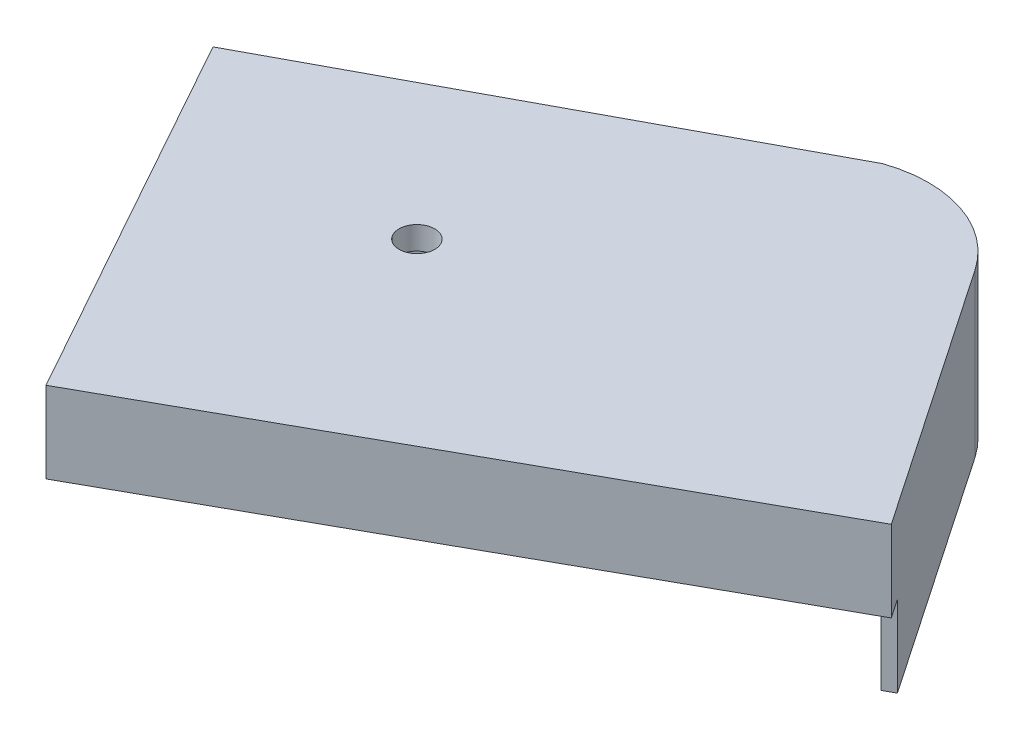
ISO-10303-21;
HEADER;
FILE_DESCRIPTION(('STEP AP214'),'2;1');
FILE_NAME('part.step','',(''),(''),'','','');
FILE_SCHEMA(('AUTOMOTIVE_DESIGN { 1 0 10303 214 1 1 1 1 }'));
ENDSEC;
DATA;
#1=APPLICATION_CONTEXT('core data for automotive mechanical design processes');
#2=APPLICATION_PROTOCOL_DEFINITION('international standard','automotive_design',2000,#1);
#3=PRODUCT_CONTEXT('',#1,'mechanical');
#4=PRODUCT('Part','Part','',(#3));
#5=PRODUCT_RELATED_PRODUCT_CATEGORY('part','',(#4));
#6=PRODUCT_DEFINITION_FORMATION('','',#4);
#7=PRODUCT_DEFINITION_CONTEXT('part definition',#1,'design');
#8=PRODUCT_DEFINITION('design','',#6,#7);
#9=PRODUCT_DEFINITION_SHAPE('','',#8);
#10=(LENGTH_UNIT() NAMED_UNIT(*) SI_UNIT(.MILLI.,.METRE.));
#11=(NAMED_UNIT(*) PLANE_ANGLE_UNIT() SI_UNIT($,.RADIAN.));
#12=(NAMED_UNIT(*) SI_UNIT($,.STERADIAN.) SOLID_ANGLE_UNIT());
#13=UNCERTAINTY_MEASURE_WITH_UNIT(LENGTH_MEASURE(1.E-05),#10,'distance_accuracy_value','');
#14=(GEOMETRIC_REPRESENTATION_CONTEXT(3) GLOBAL_UNCERTAINTY_ASSIGNED_CONTEXT((#13)) GLOBAL_UNIT_ASSIGNED_CONTEXT((#10,
#11,#12)) REPRESENTATION_CONTEXT('',''));
#15=CARTESIAN_POINT('',(0.,0.,0.));
#16=DIRECTION('',(0.,0.,1.));
#17=DIRECTION('',(1.,0.,0.));
#18=AXIS2_PLACEMENT_3D('',#15,#16,#17);
#19=CARTESIAN_POINT('',(33.7235314747771,0.,-41.3466522137133));
#20=DIRECTION('',(0.,1.,0.));
#21=DIRECTION('',(0.,0.,1.));
#22=AXIS2_PLACEMENT_3D('',#19,#20,#21);
#23=PLANE('',#22);
#24=DIRECTION('',(-0.881351269139072,0.,0.472461575566677));
#25=VECTOR('',#24,1.);
#26=CARTESIAN_POINT('',(26.0520217882454,0.,-63.8121594780564));
#27=LINE('',#26,#25);
#28=CARTESIAN_POINT('',(26.0520217882454,0.,-63.8121594780564));
#29=VERTEX_POINT('',#28);
#30=CARTESIAN_POINT('',(-65.4054363652947,0.,-14.7850163972348));
#31=VERTEX_POINT('',#30);
#32=EDGE_CURVE('E236',#29,#31,#27,.T.);
#33=ORIENTED_EDGE('',*,*,#32,.T.);
#34=DIRECTION('',(-0.486303730556802,0.,-0.873789838374502));
#35=VECTOR('',#34,1.);
#36=CARTESIAN_POINT('',(-22.9517138957504,0.,61.4957706174684));
#37=LINE('',#36,#35);
#38=CARTESIAN_POINT('',(-66.6883155522428,0.,-17.0900918613566));
#39=VERTEX_POINT('',#38);
#40=EDGE_CURVE('E277',#31,#39,#37,.T.);
#41=ORIENTED_EDGE('',*,*,#40,.T.);
#42=DIRECTION('',(-0.881351269139072,0.,0.472461575566677));
#43=VECTOR('',#42,1.);
#44=CARTESIAN_POINT('',(24.9906878047222,0.,-66.2359975735314));
#45=LINE('',#44,#43);
#46=CARTESIAN_POINT('',(24.9906878047222,0.,-66.2359975735316));
#47=VERTEX_POINT('',#46);
#48=EDGE_CURVE('E126',#47,#39,#45,.T.);
#49=ORIENTED_EDGE('',*,*,#48,.F.);
#50=CARTESIAN_POINT('',(33.7235314747771,0.,-41.3466522137133));
#51=DIRECTION('',(0.,1.,0.));
#52=DIRECTION('',(0.,0.,1.));
#53=AXIS2_PLACEMENT_3D('',#50,#51,#52);
#54=CIRCLE('',#53,26.3769230769233);
#55=CARTESIAN_POINT('',(55.5294197087094,0.,-56.187316260015));
#56=VERTEX_POINT('',#55);
#57=EDGE_CURVE('E108',#56,#47,#54,.T.);
#58=ORIENTED_EDGE('',*,*,#57,.F.);
#59=DIRECTION('',(-0.562638181982848,0.,-0.826703257629384));
#60=VECTOR('',#59,1.);
#61=CARTESIAN_POINT('',(94.9288709079823,0.,1.70362626446839));
#62=LINE('',#61,#60);
#63=CARTESIAN_POINT('',(92.0591266966087,0.,-2.51298569696083));
#64=VERTEX_POINT('',#63);
#65=EDGE_CURVE('E75',#64,#56,#62,.T.);
#66=ORIENTED_EDGE('',*,*,#65,.F.);
#67=DIRECTION('',(0.873789838374501,0.,-0.486303730556803));
#68=VECTOR('',#67,1.);
#69=CARTESIAN_POINT('',(-27.3905662746929,0.,63.966193568697));
#70=LINE('',#69,#68);
#71=CARTESIAN_POINT('',(89.7450305573049,0.,-1.22508609457588));
#72=VERTEX_POINT('',#71);
#73=EDGE_CURVE('E267',#72,#64,#70,.T.);
#74=ORIENTED_EDGE('',*,*,#73,.F.);
#75=DIRECTION('',(-0.562638181982847,0.,-0.826703257629385));
#76=VECTOR('',#75,1.);
#77=CARTESIAN_POINT('',(91.1247152743114,0.,0.802131194572775));
#78=LINE('',#77,#76);
#79=CARTESIAN_POINT('',(53.3488308853161,0.,-54.7032498553848));
#80=VERTEX_POINT('',#79);
#81=EDGE_CURVE('E137',#72,#80,#78,.T.);
#82=ORIENTED_EDGE('',*,*,#81,.T.);
#83=CARTESIAN_POINT('',(33.7235314747771,0.,-41.3466522137133));
#84=DIRECTION('',(0.,1.,0.));
#85=DIRECTION('',(0.,0.,1.));
#86=AXIS2_PLACEMENT_3D('',#83,#84,#85);
#87=CIRCLE('',#86,23.7392307692311);
#88=EDGE_CURVE('E230',#80,#29,#87,.T.);
#89=ORIENTED_EDGE('',*,*,#88,.T.);
#90=EDGE_LOOP('',(#33,#41,#49,#58,#66,#74,#82,#89));
#91=FACE_BOUND('',#90,.T.);
#92=ADVANCED_FACE('F34',(#91),#23,.F.);
#93=CARTESIAN_POINT('',(94.9288709079823,35.814,1.70362626446839));
#94=DIRECTION('',(0.486303730556803,0.,0.873789838374501));
#95=DIRECTION('',(0.873789838374501,0.,-0.486303730556802));
#96=AXIS2_PLACEMENT_3D('',#93,#94,#95);
#97=PLANE('',#96);
#98=DIRECTION('',(-0.873789838374501,0.,0.486303730556803));
#99=VECTOR('',#98,1.);
#100=CARTESIAN_POINT('',(-24.9201433234643,17.907,68.4050459476394));
#101=LINE('',#100,#99);
#102=CARTESIAN_POINT('',(94.9288709079823,17.907,1.70362626446838));
#103=VERTEX_POINT('',#102);
#104=CARTESIAN_POINT('',(-24.9201433234643,17.907,68.4050459476394));
#105=VERTEX_POINT('',#104);
#106=EDGE_CURVE('E265',#103,#105,#101,.T.);
#107=ORIENTED_EDGE('',*,*,#106,.F.);
#108=DIRECTION('',(0.,-1.,0.));
#109=VECTOR('',#108,1.);
#110=CARTESIAN_POINT('',(94.9288709079823,35.814,1.70362626446839));
#111=LINE('',#110,#109);
#112=CARTESIAN_POINT('',(94.9288709079823,35.814,1.70362626446839));
#113=VERTEX_POINT('',#112);
#114=EDGE_CURVE('E58',#113,#103,#111,.T.);
#115=ORIENTED_EDGE('',*,*,#114,.F.);
#116=DIRECTION('',(-0.873789838374501,0.,0.486303730556802));
#117=VECTOR('',#116,1.);
#118=CARTESIAN_POINT('',(94.9288709079823,35.814,1.70362626446839));
#119=LINE('',#118,#117);
#120=CARTESIAN_POINT('',(-24.9201433234643,35.814,68.4050459476394));
#121=VERTEX_POINT('',#120);
#122=EDGE_CURVE('E121',#113,#121,#119,.T.);
#123=ORIENTED_EDGE('',*,*,#122,.T.);
#124=DIRECTION('',(0.,-1.,0.));
#125=VECTOR('',#124,1.);
#126=CARTESIAN_POINT('',(-24.9201433234643,35.814,68.4050459476394));
#127=LINE('',#126,#125);
#128=EDGE_CURVE('E84',#121,#105,#127,.T.);
#129=ORIENTED_EDGE('',*,*,#128,.T.);
#130=EDGE_LOOP('',(#107,#115,#123,#129));
#131=FACE_BOUND('',#130,.T.);
#132=ADVANCED_FACE('F36',(#131),#97,.T.);
#133=CARTESIAN_POINT('',(94.9288709079823,35.814,1.70362626446839));
#134=DIRECTION('',(-0.826703257629384,0.,0.562638181982848));
#135=DIRECTION('',(0.562638181982848,0.,0.826703257629384));
#136=AXIS2_PLACEMENT_3D('',#133,#134,#135);
#137=PLANE('',#136);
#138=ORIENTED_EDGE('',*,*,#114,.T.);
#139=DIRECTION('',(-0.562638181982848,0.,-0.826703257629384));
#140=VECTOR('',#139,1.);
#141=CARTESIAN_POINT('',(94.9288709079823,17.907,1.70362626446839));
#142=LINE('',#141,#140);
#143=CARTESIAN_POINT('',(92.0591266966087,17.907,-2.51298569696083));
#144=VERTEX_POINT('',#143);
#145=EDGE_CURVE('E257',#103,#144,#142,.T.);
#146=ORIENTED_EDGE('',*,*,#145,.T.);
#147=DIRECTION('',(0.,-1.,0.));
#148=VECTOR('',#147,1.);
#149=CARTESIAN_POINT('',(92.0591266966086,35.814,-2.51298569696083));
#150=LINE('',#149,#148);
#151=EDGE_CURVE('E253',#144,#64,#150,.T.);
#152=ORIENTED_EDGE('',*,*,#151,.T.);
#153=ORIENTED_EDGE('',*,*,#65,.T.);
#154=DIRECTION('',(0.,-1.,0.));
#155=VECTOR('',#154,1.);
#156=CARTESIAN_POINT('',(55.5294197087094,35.814,-56.187316260015));
#157=LINE('',#156,#155);
#158=CARTESIAN_POINT('',(55.5294197087094,35.814,-56.187316260015));
#159=VERTEX_POINT('',#158);
#160=EDGE_CURVE('E112',#159,#56,#157,.T.);
#161=ORIENTED_EDGE('',*,*,#160,.F.);
#162=DIRECTION('',(-0.562638181982848,0.,-0.826703257629384));
#163=VECTOR('',#162,1.);
#164=CARTESIAN_POINT('',(94.9288709079823,35.814,1.70362626446839));
#165=LINE('',#164,#163);
#166=EDGE_CURVE('E101',#113,#159,#165,.T.);
#167=ORIENTED_EDGE('',*,*,#166,.F.);
#168=EDGE_LOOP('',(#138,#146,#152,#153,#161,#167));
#169=FACE_BOUND('',#168,.T.);
#170=ADVANCED_FACE('F308',(#169),#137,.F.);
#171=CARTESIAN_POINT('',(33.7235314747771,35.814,-41.3466522137133));
#172=DIRECTION('',(0.,-1.,0.));
#173=DIRECTION('',(0.,0.,-1.));
#174=AXIS2_PLACEMENT_3D('',#171,#172,#173);
#175=CYLINDRICAL_SURFACE('',#174,26.3769230769233);
#176=ORIENTED_EDGE('',*,*,#57,.T.);
#177=DIRECTION('',(0.,-1.,0.));
#178=VECTOR('',#177,1.);
#179=CARTESIAN_POINT('',(24.9906878047222,35.814,-66.2359975735316));
#180=LINE('',#179,#178);
#181=CARTESIAN_POINT('',(24.9906878047222,35.814,-66.2359975735316));
#182=VERTEX_POINT('',#181);
#183=EDGE_CURVE('E105',#182,#47,#180,.T.);
#184=ORIENTED_EDGE('',*,*,#183,.F.);
#185=CARTESIAN_POINT('',(33.7235314747771,35.814,-41.3466522137133));
#186=DIRECTION('',(0.,1.,0.));
#187=DIRECTION('',(0.,0.,1.));
#188=AXIS2_PLACEMENT_3D('',#185,#186,#187);
#189=CIRCLE('',#188,26.3769230769233);
#190=EDGE_CURVE('E94',#159,#182,#189,.T.);
#191=ORIENTED_EDGE('',*,*,#190,.F.);
#192=ORIENTED_EDGE('',*,*,#160,.T.);
#193=EDGE_LOOP('',(#176,#184,#191,#192));
#194=FACE_BOUND('',#193,.T.);
#195=ADVANCED_FACE('F106',(#194),#175,.T.);
#196=CARTESIAN_POINT('',(24.9906878047222,35.814,-66.2359975735314));
#197=DIRECTION('',(0.472461575566677,0.,0.881351269139072));
#198=DIRECTION('',(0.881351269139072,0.,-0.472461575566677));
#199=AXIS2_PLACEMENT_3D('',#196,#197,#198);
#200=PLANE('',#199);
#201=DIRECTION('',(0.,1.,0.));
#202=VECTOR('',#201,1.);
#203=CARTESIAN_POINT('',(-66.6883155522428,35.814,-17.0900918613566));
#204=LINE('',#203,#202);
#205=CARTESIAN_POINT('',(-66.6883155522428,17.907,-17.0900918613566));
#206=VERTEX_POINT('',#205);
#207=EDGE_CURVE('E268',#39,#206,#204,.T.);
#208=ORIENTED_EDGE('',*,*,#207,.T.);
#209=DIRECTION('',(-0.881351269139072,0.,0.472461575566677));
#210=VECTOR('',#209,1.);
#211=CARTESIAN_POINT('',(24.9906878047222,17.907,-66.2359975735314));
#212=LINE('',#211,#210);
#213=CARTESIAN_POINT('',(-71.1661369967758,17.907,-14.689688470712));
#214=VERTEX_POINT('',#213);
#215=EDGE_CURVE('E273',#206,#214,#212,.T.);
#216=ORIENTED_EDGE('',*,*,#215,.T.);
#217=DIRECTION('',(0.,-1.,0.));
#218=VECTOR('',#217,1.);
#219=CARTESIAN_POINT('',(-71.1661369967757,35.814,-14.6896884707121));
#220=LINE('',#219,#218);
#221=CARTESIAN_POINT('',(-71.1661369967757,35.814,-14.6896884707121));
#222=VERTEX_POINT('',#221);
#223=EDGE_CURVE('E113',#222,#214,#220,.T.);
#224=ORIENTED_EDGE('',*,*,#223,.F.);
#225=DIRECTION('',(-0.881351269139072,0.,0.472461575566677));
#226=VECTOR('',#225,1.);
#227=CARTESIAN_POINT('',(24.9906878047222,35.814,-66.2359975735314));
#228=LINE('',#227,#226);
#229=EDGE_CURVE('E99',#182,#222,#228,.T.);
#230=ORIENTED_EDGE('',*,*,#229,.F.);
#231=ORIENTED_EDGE('',*,*,#183,.T.);
#232=ORIENTED_EDGE('',*,*,#48,.T.);
#233=EDGE_LOOP('',(#208,#216,#224,#230,#231,#232));
#234=FACE_BOUND('',#233,.T.);
#235=ADVANCED_FACE('F116',(#234),#200,.F.);
#236=CARTESIAN_POINT('',(-24.9201433234643,35.814,68.4050459476394));
#237=DIRECTION('',(-0.873789838374501,0.,0.486303730556802));
#238=DIRECTION('',(0.486303730556802,0.,0.873789838374502));
#239=AXIS2_PLACEMENT_3D('',#236,#237,#238);
#240=PLANE('',#239);
#241=ORIENTED_EDGE('',*,*,#223,.T.);
#242=DIRECTION('',(0.486303730556803,0.,0.873789838374501));
#243=VECTOR('',#242,1.);
#244=CARTESIAN_POINT('',(-27.3905662746929,17.907,63.966193568697));
#245=LINE('',#244,#243);
#246=EDGE_CURVE('E176',#214,#105,#245,.T.);
#247=ORIENTED_EDGE('',*,*,#246,.T.);
#248=ORIENTED_EDGE('',*,*,#128,.F.);
#249=DIRECTION('',(-0.486303730556802,0.,-0.873789838374501));
#250=VECTOR('',#249,1.);
#251=CARTESIAN_POINT('',(-24.9201433234643,35.814,68.4050459476394));
#252=LINE('',#251,#250);
#253=EDGE_CURVE('E119',#121,#222,#252,.T.);
#254=ORIENTED_EDGE('',*,*,#253,.T.);
#255=EDGE_LOOP('',(#241,#247,#248,#254));
#256=FACE_BOUND('',#255,.T.);
#257=ADVANCED_FACE('F173',(#256),#240,.T.);
#258=CARTESIAN_POINT('',(33.7235314747771,35.814,-41.3466522137133));
#259=DIRECTION('',(0.,1.,0.));
#260=DIRECTION('',(0.,0.,1.));
#261=AXIS2_PLACEMENT_3D('',#258,#259,#260);
#262=PLANE('',#261);
#263=CARTESIAN_POINT('',(-11.9241561411378,35.814,-0.453613659759336));
#264=DIRECTION('',(0.,1.,0.));
#265=DIRECTION('',(0.,0.,1.));
#266=AXIS2_PLACEMENT_3D('',#263,#264,#265);
#267=CIRCLE('',#266,3.937);
#268=CARTESIAN_POINT('',(-11.9241561411378,35.814,3.48338634024066));
#269=VERTEX_POINT('',#268);
#270=EDGE_CURVE('E138',#269,#269,#267,.T.);
#271=ORIENTED_EDGE('',*,*,#270,.F.);
#272=EDGE_LOOP('',(#271));
#273=FACE_BOUND('',#272,.T.);
#274=ORIENTED_EDGE('',*,*,#122,.F.);
#275=ORIENTED_EDGE('',*,*,#166,.T.);
#276=ORIENTED_EDGE('',*,*,#190,.T.);
#277=ORIENTED_EDGE('',*,*,#229,.T.);
#278=ORIENTED_EDGE('',*,*,#253,.F.);
#279=EDGE_LOOP('',(#274,#275,#276,#277,#278));
#280=FACE_BOUND('',#279,.T.);
#281=ADVANCED_FACE('F97',(#273,#280),#262,.T.);
#282=CARTESIAN_POINT('',(91.1247152743114,30.734,0.802131194572775));
#283=DIRECTION('',(-0.826703257629384,0.,0.562638181982847));
#284=DIRECTION('',(0.562638181982847,0.,0.826703257629385));
#285=AXIS2_PLACEMENT_3D('',#282,#283,#284);
#286=PLANE('',#285);
#287=DIRECTION('',(-0.562638181982847,0.,-0.826703257629385));
#288=VECTOR('',#287,1.);
#289=CARTESIAN_POINT('',(91.1247152743114,17.907,0.802131194572775));
#290=LINE('',#289,#288);
#291=CARTESIAN_POINT('',(91.1247152743114,17.907,0.802131194572775));
#292=VERTEX_POINT('',#291);
#293=CARTESIAN_POINT('',(89.7450305573049,17.907,-1.22508609457588));
#294=VERTEX_POINT('',#293);
#295=EDGE_CURVE('E260',#292,#294,#290,.T.);
#296=ORIENTED_EDGE('',*,*,#295,.F.);
#297=DIRECTION('',(0.,-1.,0.));
#298=VECTOR('',#297,1.);
#299=CARTESIAN_POINT('',(91.1247152743114,30.734,0.802131194572775));
#300=LINE('',#299,#298);
#301=CARTESIAN_POINT('',(91.1247152743114,30.734,0.802131194572775));
#302=VERTEX_POINT('',#301);
#303=EDGE_CURVE('E150',#302,#292,#300,.T.);
#304=ORIENTED_EDGE('',*,*,#303,.F.);
#305=DIRECTION('',(-0.562638181982847,0.,-0.826703257629385));
#306=VECTOR('',#305,1.);
#307=CARTESIAN_POINT('',(91.1247152743114,30.734,0.802131194572775));
#308=LINE('',#307,#306);
#309=CARTESIAN_POINT('',(53.3488308853161,30.734,-54.7032498553848));
#310=VERTEX_POINT('',#309);
#311=EDGE_CURVE('E240',#302,#310,#308,.T.);
#312=ORIENTED_EDGE('',*,*,#311,.T.);
#313=DIRECTION('',(0.,-1.,0.));
#314=VECTOR('',#313,1.);
#315=CARTESIAN_POINT('',(53.3488308853161,30.734,-54.7032498553848));
#316=LINE('',#315,#314);
#317=EDGE_CURVE('E128',#310,#80,#316,.T.);
#318=ORIENTED_EDGE('',*,*,#317,.T.);
#319=ORIENTED_EDGE('',*,*,#81,.F.);
#320=DIRECTION('',(0.,-1.,0.));
#321=VECTOR('',#320,1.);
#322=CARTESIAN_POINT('',(89.7450305573048,30.734,-1.22508609457587));
#323=LINE('',#322,#321);
#324=EDGE_CURVE('E255',#294,#72,#323,.T.);
#325=ORIENTED_EDGE('',*,*,#324,.F.);
#326=EDGE_LOOP('',(#296,#304,#312,#318,#319,#325));
#327=FACE_BOUND('',#326,.T.);
#328=ADVANCED_FACE('F287',(#327),#286,.T.);
#329=CARTESIAN_POINT('',(33.7235314747771,30.734,-41.3466522137133));
#330=DIRECTION('',(0.,-1.,0.));
#331=DIRECTION('',(0.,0.,-1.));
#332=AXIS2_PLACEMENT_3D('',#329,#330,#331);
#333=CYLINDRICAL_SURFACE('',#332,23.7392307692311);
#334=ORIENTED_EDGE('',*,*,#88,.F.);
#335=ORIENTED_EDGE('',*,*,#317,.F.);
#336=CARTESIAN_POINT('',(33.7235314747771,30.734,-41.3466522137133));
#337=DIRECTION('',(0.,1.,0.));
#338=DIRECTION('',(0.,0.,1.));
#339=AXIS2_PLACEMENT_3D('',#336,#337,#338);
#340=CIRCLE('',#339,23.7392307692311);
#341=CARTESIAN_POINT('',(26.0520217882454,30.734,-63.8121594780564));
#342=VERTEX_POINT('',#341);
#343=EDGE_CURVE('E231',#310,#342,#340,.T.);
#344=ORIENTED_EDGE('',*,*,#343,.T.);
#345=DIRECTION('',(0.,-1.,0.));
#346=VECTOR('',#345,1.);
#347=CARTESIAN_POINT('',(26.0520217882454,30.734,-63.8121594780564));
#348=LINE('',#347,#346);
#349=EDGE_CURVE('E163',#342,#29,#348,.T.);
#350=ORIENTED_EDGE('',*,*,#349,.T.);
#351=EDGE_LOOP('',(#334,#335,#344,#350));
#352=FACE_BOUND('',#351,.T.);
#353=ADVANCED_FACE('F228',(#352),#333,.F.);
#354=CARTESIAN_POINT('',(26.0520217882454,30.734,-63.8121594780564));
#355=DIRECTION('',(0.472461575566677,0.,0.881351269139072));
#356=DIRECTION('',(0.881351269139072,0.,-0.472461575566677));
#357=AXIS2_PLACEMENT_3D('',#354,#355,#356);
#358=PLANE('',#357);
#359=DIRECTION('',(-0.881351269139072,0.,0.472461575566677));
#360=VECTOR('',#359,1.);
#361=CARTESIAN_POINT('',(26.0520217882454,17.907,-63.8121594780564));
#362=LINE('',#361,#360);
#363=CARTESIAN_POINT('',(-65.4054363652947,17.907,-14.7850163972348));
#364=VERTEX_POINT('',#363);
#365=CARTESIAN_POINT('',(-67.5582351367047,17.907,-13.6309763055788));
#366=VERTEX_POINT('',#365);
#367=EDGE_CURVE('E275',#364,#366,#362,.T.);
#368=ORIENTED_EDGE('',*,*,#367,.F.);
#369=DIRECTION('',(0.,1.,0.));
#370=VECTOR('',#369,1.);
#371=CARTESIAN_POINT('',(-65.4054363652947,30.734,-14.7850163972348));
#372=LINE('',#371,#370);
#373=EDGE_CURVE('E11',#31,#364,#372,.T.);
#374=ORIENTED_EDGE('',*,*,#373,.F.);
#375=ORIENTED_EDGE('',*,*,#32,.F.);
#376=ORIENTED_EDGE('',*,*,#349,.F.);
#377=DIRECTION('',(-0.881351269139072,0.,0.472461575566677));
#378=VECTOR('',#377,1.);
#379=CARTESIAN_POINT('',(26.0520217882454,30.734,-63.8121594780564));
#380=LINE('',#379,#378);
#381=CARTESIAN_POINT('',(-67.5582351367047,30.734,-13.6309763055788));
#382=VERTEX_POINT('',#381);
#383=EDGE_CURVE('E246',#342,#382,#380,.T.);
#384=ORIENTED_EDGE('',*,*,#383,.T.);
#385=DIRECTION('',(0.,-1.,0.));
#386=VECTOR('',#385,1.);
#387=CARTESIAN_POINT('',(-67.5582351367047,30.734,-13.6309763055788));
#388=LINE('',#387,#386);
#389=EDGE_CURVE('E160',#382,#366,#388,.T.);
#390=ORIENTED_EDGE('',*,*,#389,.T.);
#391=EDGE_LOOP('',(#368,#374,#375,#376,#384,#390));
#392=FACE_BOUND('',#391,.T.);
#393=ADVANCED_FACE('F238',(#392),#358,.T.);
#394=CARTESIAN_POINT('',(-23.8980741975359,30.734,64.8175376031275));
#395=DIRECTION('',(-0.873789838374502,0.,0.486303730556802));
#396=DIRECTION('',(0.486303730556802,0.,0.873789838374502));
#397=AXIS2_PLACEMENT_3D('',#394,#395,#396);
#398=PLANE('',#397);
#399=DIRECTION('',(-0.486303730556802,0.,-0.873789838374502));
#400=VECTOR('',#399,1.);
#401=CARTESIAN_POINT('',(-23.8980741975359,17.907,64.8175376031275));
#402=LINE('',#401,#400);
#403=CARTESIAN_POINT('',(-23.8980741975359,17.907,64.8175376031275));
#404=VERTEX_POINT('',#403);
#405=EDGE_CURVE('E49',#404,#366,#402,.T.);
#406=ORIENTED_EDGE('',*,*,#405,.T.);
#407=ORIENTED_EDGE('',*,*,#389,.F.);
#408=DIRECTION('',(-0.486303730556802,0.,-0.873789838374502));
#409=VECTOR('',#408,1.);
#410=CARTESIAN_POINT('',(-23.8980741975359,30.734,64.8175376031275));
#411=LINE('',#410,#409);
#412=CARTESIAN_POINT('',(-23.8980741975359,30.734,64.8175376031275));
#413=VERTEX_POINT('',#412);
#414=EDGE_CURVE('E158',#413,#382,#411,.T.);
#415=ORIENTED_EDGE('',*,*,#414,.F.);
#416=DIRECTION('',(0.,-1.,0.));
#417=VECTOR('',#416,1.);
#418=CARTESIAN_POINT('',(-23.8980741975359,30.734,64.8175376031275));
#419=LINE('',#418,#417);
#420=EDGE_CURVE('E146',#413,#404,#419,.T.);
#421=ORIENTED_EDGE('',*,*,#420,.T.);
#422=EDGE_LOOP('',(#406,#407,#415,#421));
#423=FACE_BOUND('',#422,.T.);
#424=ADVANCED_FACE('F154',(#423),#398,.F.);
#425=CARTESIAN_POINT('',(91.1247152743114,30.734,0.802131194572775));
#426=DIRECTION('',(0.486303730556803,0.,0.873789838374501));
#427=DIRECTION('',(0.873789838374501,0.,-0.486303730556803));
#428=AXIS2_PLACEMENT_3D('',#425,#426,#427);
#429=PLANE('',#428);
#430=ORIENTED_EDGE('',*,*,#303,.T.);
#431=DIRECTION('',(-0.873789838374501,0.,0.486303730556803));
#432=VECTOR('',#431,1.);
#433=CARTESIAN_POINT('',(91.1247152743114,17.907,0.802131194572775));
#434=LINE('',#433,#432);
#435=EDGE_CURVE('E42',#292,#404,#434,.T.);
#436=ORIENTED_EDGE('',*,*,#435,.T.);
#437=ORIENTED_EDGE('',*,*,#420,.F.);
#438=DIRECTION('',(-0.873789838374501,0.,0.486303730556803));
#439=VECTOR('',#438,1.);
#440=CARTESIAN_POINT('',(91.1247152743114,30.734,0.802131194572775));
#441=LINE('',#440,#439);
#442=EDGE_CURVE('E165',#302,#413,#441,.T.);
#443=ORIENTED_EDGE('',*,*,#442,.F.);
#444=EDGE_LOOP('',(#430,#436,#437,#443));
#445=FACE_BOUND('',#444,.T.);
#446=ADVANCED_FACE('F143',(#445),#429,.F.);
#447=CARTESIAN_POINT('',(33.7235314747771,30.734,-41.3466522137133));
#448=DIRECTION('',(0.,1.,0.));
#449=DIRECTION('',(0.,0.,1.));
#450=AXIS2_PLACEMENT_3D('',#447,#448,#449);
#451=PLANE('',#450);
#452=CARTESIAN_POINT('',(-11.9241561411378,30.734,-0.453613659759336));
#453=DIRECTION('',(0.,1.,0.));
#454=DIRECTION('',(0.,0.,1.));
#455=AXIS2_PLACEMENT_3D('',#452,#453,#454);
#456=CIRCLE('',#455,3.937);
#457=CARTESIAN_POINT('',(-11.9241561411378,30.734,3.48338634024066));
#458=VERTEX_POINT('',#457);
#459=EDGE_CURVE('E135',#458,#458,#456,.T.);
#460=ORIENTED_EDGE('',*,*,#459,.T.);
#461=EDGE_LOOP('',(#460));
#462=FACE_BOUND('',#461,.T.);
#463=ORIENTED_EDGE('',*,*,#311,.F.);
#464=ORIENTED_EDGE('',*,*,#442,.T.);
#465=ORIENTED_EDGE('',*,*,#414,.T.);
#466=ORIENTED_EDGE('',*,*,#383,.F.);
#467=ORIENTED_EDGE('',*,*,#343,.F.);
#468=EDGE_LOOP('',(#463,#464,#465,#466,#467));
#469=FACE_BOUND('',#468,.T.);
#470=ADVANCED_FACE('F290',(#462,#469),#451,.F.);
#471=CARTESIAN_POINT('',(-11.9241561411378,23.114,-0.453613659759336));
#472=DIRECTION('',(0.,1.,0.));
#473=DIRECTION('',(0.,0.,1.));
#474=AXIS2_PLACEMENT_3D('',#471,#472,#473);
#475=CYLINDRICAL_SURFACE('',#474,3.937);
#476=ORIENTED_EDGE('',*,*,#270,.T.);
#477=EDGE_LOOP('',(#476));
#478=FACE_BOUND('',#477,.T.);
#479=ORIENTED_EDGE('',*,*,#459,.F.);
#480=EDGE_LOOP('',(#479));
#481=FACE_BOUND('',#480,.T.);
#482=ADVANCED_FACE('F300',(#478,#481),#475,.F.);
#483=CARTESIAN_POINT('',(20.7033481170347,0.,37.1997458960101));
#484=DIRECTION('',(-0.486303730556803,0.,-0.873789838374501));
#485=DIRECTION('',(-0.873789838374501,0.,0.486303730556803));
#486=AXIS2_PLACEMENT_3D('',#483,#484,#485);
#487=PLANE('',#486);
#488=DIRECTION('',(-0.873789838374501,0.,0.486303730556803));
#489=VECTOR('',#488,1.);
#490=CARTESIAN_POINT('',(-27.3905662746929,17.907,63.966193568697));
#491=LINE('',#490,#489);
#492=EDGE_CURVE('E264',#144,#294,#491,.T.);
#493=ORIENTED_EDGE('',*,*,#492,.T.);
#494=ORIENTED_EDGE('',*,*,#324,.T.);
#495=ORIENTED_EDGE('',*,*,#73,.T.);
#496=ORIENTED_EDGE('',*,*,#151,.F.);
#497=EDGE_LOOP('',(#493,#494,#495,#496));
#498=FACE_BOUND('',#497,.T.);
#499=ADVANCED_FACE('F293',(#498),#487,.F.);
#500=CARTESIAN_POINT('',(-27.3905662746929,17.907,63.966193568697));
#501=DIRECTION('',(0.,1.,0.));
#502=DIRECTION('',(0.,0.,1.));
#503=AXIS2_PLACEMENT_3D('',#500,#501,#502);
#504=PLANE('',#503);
#505=ORIENTED_EDGE('',*,*,#106,.T.);
#506=ORIENTED_EDGE('',*,*,#246,.F.);
#507=ORIENTED_EDGE('',*,*,#215,.F.);
#508=DIRECTION('',(-0.486303730556802,0.,-0.873789838374502));
#509=VECTOR('',#508,1.);
#510=CARTESIAN_POINT('',(-22.9517138957504,17.907,61.4957706174684));
#511=LINE('',#510,#509);
#512=EDGE_CURVE('E279',#364,#206,#511,.T.);
#513=ORIENTED_EDGE('',*,*,#512,.F.);
#514=ORIENTED_EDGE('',*,*,#367,.T.);
#515=ORIENTED_EDGE('',*,*,#405,.F.);
#516=ORIENTED_EDGE('',*,*,#435,.F.);
#517=ORIENTED_EDGE('',*,*,#295,.T.);
#518=ORIENTED_EDGE('',*,*,#492,.F.);
#519=ORIENTED_EDGE('',*,*,#145,.F.);
#520=EDGE_LOOP('',(#505,#506,#507,#513,#514,#515,#516,#517,#518,#519));
#521=FACE_BOUND('',#520,.T.);
#522=ADVANCED_FACE('F291',(#521),#504,.F.);
#523=CARTESIAN_POINT('',(-43.6550620127851,0.,24.2960247214583));
#524=DIRECTION('',(0.873789838374502,0.,-0.486303730556802));
#525=DIRECTION('',(-0.486303730556802,0.,-0.873789838374502));
#526=AXIS2_PLACEMENT_3D('',#523,#524,#525);
#527=PLANE('',#526);
#528=ORIENTED_EDGE('',*,*,#40,.F.);
#529=ORIENTED_EDGE('',*,*,#373,.T.);
#530=ORIENTED_EDGE('',*,*,#512,.T.);
#531=ORIENTED_EDGE('',*,*,#207,.F.);
#532=EDGE_LOOP('',(#528,#529,#530,#531));
#533=FACE_BOUND('',#532,.T.);
#534=ADVANCED_FACE('F283',(#533),#527,.F.);
#535=CLOSED_SHELL('',(#92,#132,#170,#195,#235,#257,#281,#328,#353,#393,#424,#446,#470,#482,#499,
#522,#534));
#536=MANIFOLD_SOLID_BREP('B2',#535);
#537=ADVANCED_BREP_SHAPE_REPRESENTATION('',(#18,#536),#14);
#538=SHAPE_DEFINITION_REPRESENTATION(#9,#537);
ENDSEC;
END-ISO-10303-21;
